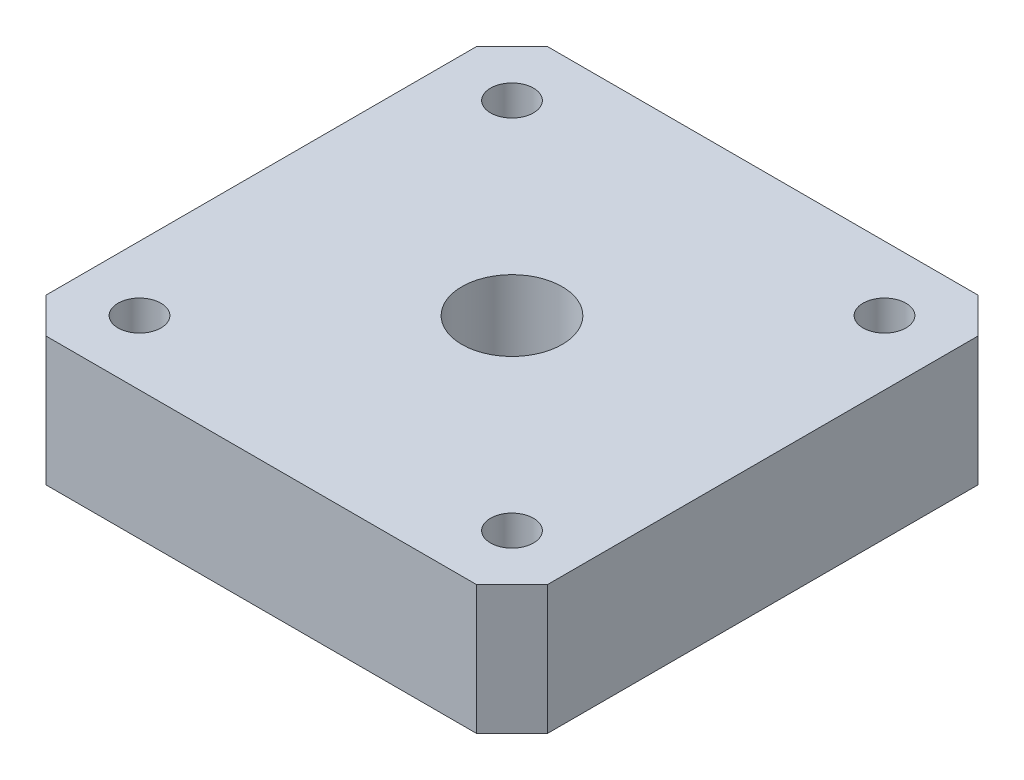
ISO-10303-21;
HEADER;
FILE_DESCRIPTION(('STEP AP214'),'2;1');
FILE_NAME('part.step','',(''),(''),'','','');
FILE_SCHEMA(('AUTOMOTIVE_DESIGN { 1 0 10303 214 1 1 1 1 }'));
ENDSEC;
DATA;
#1=APPLICATION_CONTEXT('core data for automotive mechanical design processes');
#2=APPLICATION_PROTOCOL_DEFINITION('international standard','automotive_design',2000,#1);
#3=PRODUCT_CONTEXT('',#1,'mechanical');
#4=PRODUCT('Part','Part','',(#3));
#5=PRODUCT_RELATED_PRODUCT_CATEGORY('part','',(#4));
#6=PRODUCT_DEFINITION_FORMATION('','',#4);
#7=PRODUCT_DEFINITION_CONTEXT('part definition',#1,'design');
#8=PRODUCT_DEFINITION('design','',#6,#7);
#9=PRODUCT_DEFINITION_SHAPE('','',#8);
#10=(LENGTH_UNIT() NAMED_UNIT(*) SI_UNIT(.MILLI.,.METRE.));
#11=(NAMED_UNIT(*) PLANE_ANGLE_UNIT() SI_UNIT($,.RADIAN.));
#12=(NAMED_UNIT(*) SI_UNIT($,.STERADIAN.) SOLID_ANGLE_UNIT());
#13=UNCERTAINTY_MEASURE_WITH_UNIT(LENGTH_MEASURE(1.E-05),#10,'distance_accuracy_value','');
#14=(GEOMETRIC_REPRESENTATION_CONTEXT(3) GLOBAL_UNCERTAINTY_ASSIGNED_CONTEXT((#13)) GLOBAL_UNIT_ASSIGNED_CONTEXT((#10,
#11,#12)) REPRESENTATION_CONTEXT('',''));
#15=CARTESIAN_POINT('',(0.,0.,0.));
#16=DIRECTION('',(0.,0.,1.));
#17=DIRECTION('',(1.,0.,0.));
#18=AXIS2_PLACEMENT_3D('',#15,#16,#17);
#19=CARTESIAN_POINT('',(0.,9.,-32.5269119345811));
#20=DIRECTION('',(1.,0.,0.));
#21=DIRECTION('',(0.,0.,-1.));
#22=AXIS2_PLACEMENT_3D('',#19,#20,#21);
#23=PLANE('',#22);
#24=DIRECTION('',(0.,0.,1.));
#25=VECTOR('',#24,1.);
#26=CARTESIAN_POINT('',(0.,0.,-32.5269119345811));
#27=LINE('',#26,#25);
#28=CARTESIAN_POINT('',(0.,0.,-32.5269119345811));
#29=VERTEX_POINT('',#28);
#30=CARTESIAN_POINT('',(0.,0.,-2.47308806541876));
#31=VERTEX_POINT('',#30);
#32=EDGE_CURVE('E128',#29,#31,#27,.T.);
#33=ORIENTED_EDGE('',*,*,#32,.T.);
#34=DIRECTION('',(0.,-1.,0.));
#35=VECTOR('',#34,1.);
#36=CARTESIAN_POINT('',(0.,9.,-2.47308806541876));
#37=LINE('',#36,#35);
#38=CARTESIAN_POINT('',(0.,9.,-2.47308806541876));
#39=VERTEX_POINT('',#38);
#40=EDGE_CURVE('E11',#39,#31,#37,.T.);
#41=ORIENTED_EDGE('',*,*,#40,.F.);
#42=DIRECTION('',(0.,0.,1.));
#43=VECTOR('',#42,1.);
#44=CARTESIAN_POINT('',(0.,9.,-32.5269119345811));
#45=LINE('',#44,#43);
#46=CARTESIAN_POINT('',(0.,9.,-32.5269119345811));
#47=VERTEX_POINT('',#46);
#48=EDGE_CURVE('E143',#47,#39,#45,.T.);
#49=ORIENTED_EDGE('',*,*,#48,.F.);
#50=DIRECTION('',(0.,-1.,0.));
#51=VECTOR('',#50,1.);
#52=CARTESIAN_POINT('',(0.,9.,-32.5269119345811));
#53=LINE('',#52,#51);
#54=EDGE_CURVE('E124',#47,#29,#53,.T.);
#55=ORIENTED_EDGE('',*,*,#54,.T.);
#56=EDGE_LOOP('',(#33,#41,#49,#55));
#57=FACE_BOUND('',#56,.T.);
#58=ADVANCED_FACE('F32',(#57),#23,.F.);
#59=CARTESIAN_POINT('',(0.,9.,-2.47308806541876));
#60=DIRECTION('',(0.707106781186549,0.,-0.707106781186546));
#61=DIRECTION('',(-0.707106781186546,0.,-0.707106781186549));
#62=AXIS2_PLACEMENT_3D('',#59,#60,#61);
#63=PLANE('',#62);
#64=DIRECTION('',(0.707106781186546,0.,0.707106781186548));
#65=VECTOR('',#64,1.);
#66=CARTESIAN_POINT('',(0.,0.,-2.47308806541876));
#67=LINE('',#66,#65);
#68=CARTESIAN_POINT('',(2.47308806541877,0.,0.));
#69=VERTEX_POINT('',#68);
#70=EDGE_CURVE('E131',#31,#69,#67,.T.);
#71=ORIENTED_EDGE('',*,*,#70,.T.);
#72=DIRECTION('',(0.,-1.,0.));
#73=VECTOR('',#72,1.);
#74=CARTESIAN_POINT('',(2.47308806541877,9.,0.));
#75=LINE('',#74,#73);
#76=CARTESIAN_POINT('',(2.47308806541877,9.,0.));
#77=VERTEX_POINT('',#76);
#78=EDGE_CURVE('E40',#77,#69,#75,.T.);
#79=ORIENTED_EDGE('',*,*,#78,.F.);
#80=DIRECTION('',(0.707106781186546,0.,0.707106781186548));
#81=VECTOR('',#80,1.);
#82=CARTESIAN_POINT('',(0.,9.,-2.47308806541876));
#83=LINE('',#82,#81);
#84=EDGE_CURVE('E91',#39,#77,#83,.T.);
#85=ORIENTED_EDGE('',*,*,#84,.F.);
#86=ORIENTED_EDGE('',*,*,#40,.T.);
#87=EDGE_LOOP('',(#71,#79,#85,#86));
#88=FACE_BOUND('',#87,.T.);
#89=ADVANCED_FACE('F242',(#88),#63,.F.);
#90=CARTESIAN_POINT('',(2.47308806541877,9.,0.));
#91=DIRECTION('',(0.,0.,-1.));
#92=DIRECTION('',(-1.,0.,0.));
#93=AXIS2_PLACEMENT_3D('',#90,#91,#92);
#94=PLANE('',#93);
#95=DIRECTION('',(1.,0.,0.));
#96=VECTOR('',#95,1.);
#97=CARTESIAN_POINT('',(2.47308806541877,0.,0.));
#98=LINE('',#97,#96);
#99=CARTESIAN_POINT('',(32.5269119345812,0.,0.));
#100=VERTEX_POINT('',#99);
#101=EDGE_CURVE('E134',#69,#100,#98,.T.);
#102=ORIENTED_EDGE('',*,*,#101,.T.);
#103=DIRECTION('',(0.,-1.,0.));
#104=VECTOR('',#103,1.);
#105=CARTESIAN_POINT('',(32.5269119345812,9.,0.));
#106=LINE('',#105,#104);
#107=CARTESIAN_POINT('',(32.5269119345812,9.,0.));
#108=VERTEX_POINT('',#107);
#109=EDGE_CURVE('E150',#108,#100,#106,.T.);
#110=ORIENTED_EDGE('',*,*,#109,.F.);
#111=DIRECTION('',(1.,0.,0.));
#112=VECTOR('',#111,1.);
#113=CARTESIAN_POINT('',(2.47308806541877,9.,0.));
#114=LINE('',#113,#112);
#115=EDGE_CURVE('E158',#77,#108,#114,.T.);
#116=ORIENTED_EDGE('',*,*,#115,.F.);
#117=ORIENTED_EDGE('',*,*,#78,.T.);
#118=EDGE_LOOP('',(#102,#110,#116,#117));
#119=FACE_BOUND('',#118,.T.);
#120=ADVANCED_FACE('F156',(#119),#94,.F.);
#121=CARTESIAN_POINT('',(32.5269119345812,9.,0.));
#122=DIRECTION('',(-0.707106781186545,0.,-0.70710678118655));
#123=DIRECTION('',(-0.70710678118655,0.,0.707106781186545));
#124=AXIS2_PLACEMENT_3D('',#121,#122,#123);
#125=PLANE('',#124);
#126=DIRECTION('',(0.70710678118655,0.,-0.707106781186545));
#127=VECTOR('',#126,1.);
#128=CARTESIAN_POINT('',(32.5269119345812,0.,0.));
#129=LINE('',#128,#127);
#130=CARTESIAN_POINT('',(35.,0.,-2.47308806541876));
#131=VERTEX_POINT('',#130);
#132=EDGE_CURVE('E136',#100,#131,#129,.T.);
#133=ORIENTED_EDGE('',*,*,#132,.T.);
#134=DIRECTION('',(0.,-1.,0.));
#135=VECTOR('',#134,1.);
#136=CARTESIAN_POINT('',(35.,9.,-2.47308806541876));
#137=LINE('',#136,#135);
#138=CARTESIAN_POINT('',(35.,9.,-2.47308806541876));
#139=VERTEX_POINT('',#138);
#140=EDGE_CURVE('E147',#139,#131,#137,.T.);
#141=ORIENTED_EDGE('',*,*,#140,.F.);
#142=DIRECTION('',(0.70710678118655,0.,-0.707106781186545));
#143=VECTOR('',#142,1.);
#144=CARTESIAN_POINT('',(32.5269119345812,9.,0.));
#145=LINE('',#144,#143);
#146=EDGE_CURVE('E170',#108,#139,#145,.T.);
#147=ORIENTED_EDGE('',*,*,#146,.F.);
#148=ORIENTED_EDGE('',*,*,#109,.T.);
#149=EDGE_LOOP('',(#133,#141,#147,#148));
#150=FACE_BOUND('',#149,.T.);
#151=ADVANCED_FACE('F166',(#150),#125,.F.);
#152=CARTESIAN_POINT('',(35.,9.,-2.47308806541876));
#153=DIRECTION('',(-1.,0.,0.));
#154=DIRECTION('',(0.,0.,1.));
#155=AXIS2_PLACEMENT_3D('',#152,#153,#154);
#156=PLANE('',#155);
#157=DIRECTION('',(0.,0.,-1.));
#158=VECTOR('',#157,1.);
#159=CARTESIAN_POINT('',(35.,0.,-2.47308806541876));
#160=LINE('',#159,#158);
#161=CARTESIAN_POINT('',(35.,0.,-32.5269119345811));
#162=VERTEX_POINT('',#161);
#163=EDGE_CURVE('E138',#131,#162,#160,.T.);
#164=ORIENTED_EDGE('',*,*,#163,.T.);
#165=DIRECTION('',(0.,-1.,0.));
#166=VECTOR('',#165,1.);
#167=CARTESIAN_POINT('',(35.,9.,-32.5269119345811));
#168=LINE('',#167,#166);
#169=CARTESIAN_POINT('',(35.,9.,-32.5269119345811));
#170=VERTEX_POINT('',#169);
#171=EDGE_CURVE('E119',#170,#162,#168,.T.);
#172=ORIENTED_EDGE('',*,*,#171,.F.);
#173=DIRECTION('',(0.,0.,-1.));
#174=VECTOR('',#173,1.);
#175=CARTESIAN_POINT('',(35.,9.,-2.47308806541876));
#176=LINE('',#175,#174);
#177=EDGE_CURVE('E110',#139,#170,#176,.T.);
#178=ORIENTED_EDGE('',*,*,#177,.F.);
#179=ORIENTED_EDGE('',*,*,#140,.T.);
#180=EDGE_LOOP('',(#164,#172,#178,#179));
#181=FACE_BOUND('',#180,.T.);
#182=ADVANCED_FACE('F169',(#181),#156,.F.);
#183=CARTESIAN_POINT('',(35.,9.,-32.5269119345811));
#184=DIRECTION('',(-0.707106781186548,0.,0.707106781186547));
#185=DIRECTION('',(0.707106781186547,0.,0.707106781186548));
#186=AXIS2_PLACEMENT_3D('',#183,#184,#185);
#187=PLANE('',#186);
#188=DIRECTION('',(-0.707106781186547,0.,-0.707106781186549));
#189=VECTOR('',#188,1.);
#190=CARTESIAN_POINT('',(35.,0.,-32.5269119345811));
#191=LINE('',#190,#189);
#192=CARTESIAN_POINT('',(32.5269119345812,0.,-34.9999999999999));
#193=VERTEX_POINT('',#192);
#194=EDGE_CURVE('E118',#162,#193,#191,.T.);
#195=ORIENTED_EDGE('',*,*,#194,.T.);
#196=DIRECTION('',(0.,-1.,0.));
#197=VECTOR('',#196,1.);
#198=CARTESIAN_POINT('',(32.5269119345812,9.,-34.9999999999999));
#199=LINE('',#198,#197);
#200=CARTESIAN_POINT('',(32.5269119345812,9.,-34.9999999999999));
#201=VERTEX_POINT('',#200);
#202=EDGE_CURVE('E115',#201,#193,#199,.T.);
#203=ORIENTED_EDGE('',*,*,#202,.F.);
#204=DIRECTION('',(-0.707106781186547,0.,-0.707106781186549));
#205=VECTOR('',#204,1.);
#206=CARTESIAN_POINT('',(35.,9.,-32.5269119345811));
#207=LINE('',#206,#205);
#208=EDGE_CURVE('E104',#170,#201,#207,.T.);
#209=ORIENTED_EDGE('',*,*,#208,.F.);
#210=ORIENTED_EDGE('',*,*,#171,.T.);
#211=EDGE_LOOP('',(#195,#203,#209,#210));
#212=FACE_BOUND('',#211,.T.);
#213=ADVANCED_FACE('F116',(#212),#187,.F.);
#214=CARTESIAN_POINT('',(32.5269119345812,9.,-34.9999999999999));
#215=DIRECTION('',(0.,0.,1.));
#216=DIRECTION('',(1.,0.,0.));
#217=AXIS2_PLACEMENT_3D('',#214,#215,#216);
#218=PLANE('',#217);
#219=DIRECTION('',(-1.,0.,0.));
#220=VECTOR('',#219,1.);
#221=CARTESIAN_POINT('',(32.5269119345812,0.,-34.9999999999999));
#222=LINE('',#221,#220);
#223=CARTESIAN_POINT('',(2.47308806541877,0.,-34.9999999999999));
#224=VERTEX_POINT('',#223);
#225=EDGE_CURVE('E77',#193,#224,#222,.T.);
#226=ORIENTED_EDGE('',*,*,#225,.T.);
#227=DIRECTION('',(0.,-1.,0.));
#228=VECTOR('',#227,1.);
#229=CARTESIAN_POINT('',(2.47308806541877,9.,-34.9999999999999));
#230=LINE('',#229,#228);
#231=CARTESIAN_POINT('',(2.47308806541877,9.,-34.9999999999999));
#232=VERTEX_POINT('',#231);
#233=EDGE_CURVE('E120',#232,#224,#230,.T.);
#234=ORIENTED_EDGE('',*,*,#233,.F.);
#235=DIRECTION('',(-1.,0.,0.));
#236=VECTOR('',#235,1.);
#237=CARTESIAN_POINT('',(32.5269119345812,9.,-34.9999999999999));
#238=LINE('',#237,#236);
#239=EDGE_CURVE('E108',#201,#232,#238,.T.);
#240=ORIENTED_EDGE('',*,*,#239,.F.);
#241=ORIENTED_EDGE('',*,*,#202,.T.);
#242=EDGE_LOOP('',(#226,#234,#240,#241));
#243=FACE_BOUND('',#242,.T.);
#244=ADVANCED_FACE('F122',(#243),#218,.F.);
#245=CARTESIAN_POINT('',(2.47308806541877,9.,-34.9999999999999));
#246=DIRECTION('',(0.707106781186547,0.,0.707106781186548));
#247=DIRECTION('',(0.707106781186548,0.,-0.707106781186547));
#248=AXIS2_PLACEMENT_3D('',#245,#246,#247);
#249=PLANE('',#248);
#250=DIRECTION('',(-0.707106781186549,0.,0.707106781186547));
#251=VECTOR('',#250,1.);
#252=CARTESIAN_POINT('',(2.47308806541877,0.,-34.9999999999999));
#253=LINE('',#252,#251);
#254=EDGE_CURVE('E83',#224,#29,#253,.T.);
#255=ORIENTED_EDGE('',*,*,#254,.T.);
#256=ORIENTED_EDGE('',*,*,#54,.F.);
#257=DIRECTION('',(-0.707106781186549,0.,0.707106781186547));
#258=VECTOR('',#257,1.);
#259=CARTESIAN_POINT('',(2.47308806541877,9.,-34.9999999999999));
#260=LINE('',#259,#258);
#261=EDGE_CURVE('E48',#232,#47,#260,.T.);
#262=ORIENTED_EDGE('',*,*,#261,.F.);
#263=ORIENTED_EDGE('',*,*,#233,.T.);
#264=EDGE_LOOP('',(#255,#256,#262,#263));
#265=FACE_BOUND('',#264,.T.);
#266=ADVANCED_FACE('F217',(#265),#249,.F.);
#267=CARTESIAN_POINT('',(0.,9.,0.));
#268=DIRECTION('',(0.,1.,0.));
#269=DIRECTION('',(0.,0.,1.));
#270=AXIS2_PLACEMENT_3D('',#267,#268,#269);
#271=PLANE('',#270);
#272=CARTESIAN_POINT('',(4.5000000000006,9.,-4.50000000000008));
#273=DIRECTION('',(0.,1.,0.));
#274=DIRECTION('',(0.,0.,1.));
#275=AXIS2_PLACEMENT_3D('',#272,#273,#274);
#276=CIRCLE('',#275,1.5);
#277=CARTESIAN_POINT('',(4.5000000000006,9.,-3.00000000000007));
#278=VERTEX_POINT('',#277);
#279=EDGE_CURVE('E200',#278,#278,#276,.T.);
#280=ORIENTED_EDGE('',*,*,#279,.F.);
#281=EDGE_LOOP('',(#280));
#282=FACE_BOUND('',#281,.T.);
#283=CARTESIAN_POINT('',(30.5000000000006,9.,-4.50000000000058));
#284=DIRECTION('',(0.,1.,0.));
#285=DIRECTION('',(0.,0.,1.));
#286=AXIS2_PLACEMENT_3D('',#283,#284,#285);
#287=CIRCLE('',#286,1.5);
#288=CARTESIAN_POINT('',(30.5000000000006,9.,-3.00000000000058));
#289=VERTEX_POINT('',#288);
#290=EDGE_CURVE('E194',#289,#289,#287,.T.);
#291=ORIENTED_EDGE('',*,*,#290,.F.);
#292=EDGE_LOOP('',(#291));
#293=FACE_BOUND('',#292,.T.);
#294=CARTESIAN_POINT('',(30.5,9.,-30.5000000000006));
#295=DIRECTION('',(0.,1.,0.));
#296=DIRECTION('',(0.,0.,1.));
#297=AXIS2_PLACEMENT_3D('',#294,#295,#296);
#298=CIRCLE('',#297,1.5);
#299=CARTESIAN_POINT('',(30.5,9.,-29.0000000000006));
#300=VERTEX_POINT('',#299);
#301=EDGE_CURVE('E188',#300,#300,#298,.T.);
#302=ORIENTED_EDGE('',*,*,#301,.F.);
#303=EDGE_LOOP('',(#302));
#304=FACE_BOUND('',#303,.T.);
#305=CARTESIAN_POINT('',(4.5,9.,-30.4999999999999));
#306=DIRECTION('',(0.,1.,0.));
#307=DIRECTION('',(0.,0.,1.));
#308=AXIS2_PLACEMENT_3D('',#305,#306,#307);
#309=CIRCLE('',#308,1.5);
#310=CARTESIAN_POINT('',(4.5,9.,-28.9999999999999));
#311=VERTEX_POINT('',#310);
#312=EDGE_CURVE('E182',#311,#311,#309,.T.);
#313=ORIENTED_EDGE('',*,*,#312,.F.);
#314=EDGE_LOOP('',(#313));
#315=FACE_BOUND('',#314,.T.);
#316=CARTESIAN_POINT('',(17.5,9.,-17.4999999999999));
#317=DIRECTION('',(0.,1.,0.));
#318=DIRECTION('',(0.,0.,1.));
#319=AXIS2_PLACEMENT_3D('',#316,#317,#318);
#320=CIRCLE('',#319,3.5);
#321=CARTESIAN_POINT('',(17.5,9.,-13.9999999999999));
#322=VERTEX_POINT('',#321);
#323=EDGE_CURVE('E176',#322,#322,#320,.T.);
#324=ORIENTED_EDGE('',*,*,#323,.F.);
#325=EDGE_LOOP('',(#324));
#326=FACE_BOUND('',#325,.T.);
#327=ORIENTED_EDGE('',*,*,#48,.T.);
#328=ORIENTED_EDGE('',*,*,#84,.T.);
#329=ORIENTED_EDGE('',*,*,#115,.T.);
#330=ORIENTED_EDGE('',*,*,#146,.T.);
#331=ORIENTED_EDGE('',*,*,#177,.T.);
#332=ORIENTED_EDGE('',*,*,#208,.T.);
#333=ORIENTED_EDGE('',*,*,#239,.T.);
#334=ORIENTED_EDGE('',*,*,#261,.T.);
#335=EDGE_LOOP('',(#327,#328,#329,#330,#331,#332,#333,#334));
#336=FACE_BOUND('',#335,.T.);
#337=ADVANCED_FACE('F106',(#282,#293,#304,#315,#326,#336),#271,.T.);
#338=CARTESIAN_POINT('',(0.,0.,0.));
#339=DIRECTION('',(0.,1.,0.));
#340=DIRECTION('',(0.,0.,1.));
#341=AXIS2_PLACEMENT_3D('',#338,#339,#340);
#342=PLANE('',#341);
#343=CARTESIAN_POINT('',(4.5000000000006,0.,-4.50000000000008));
#344=DIRECTION('',(0.,1.,0.));
#345=DIRECTION('',(0.,0.,1.));
#346=AXIS2_PLACEMENT_3D('',#343,#344,#345);
#347=CIRCLE('',#346,1.5);
#348=CARTESIAN_POINT('',(4.5000000000006,0.,-3.00000000000007));
#349=VERTEX_POINT('',#348);
#350=EDGE_CURVE('E197',#349,#349,#347,.T.);
#351=ORIENTED_EDGE('',*,*,#350,.T.);
#352=EDGE_LOOP('',(#351));
#353=FACE_BOUND('',#352,.T.);
#354=CARTESIAN_POINT('',(30.5000000000006,0.,-4.50000000000058));
#355=DIRECTION('',(0.,1.,0.));
#356=DIRECTION('',(0.,0.,1.));
#357=AXIS2_PLACEMENT_3D('',#354,#355,#356);
#358=CIRCLE('',#357,1.5);
#359=CARTESIAN_POINT('',(30.5000000000006,0.,-3.00000000000058));
#360=VERTEX_POINT('',#359);
#361=EDGE_CURVE('E191',#360,#360,#358,.T.);
#362=ORIENTED_EDGE('',*,*,#361,.T.);
#363=EDGE_LOOP('',(#362));
#364=FACE_BOUND('',#363,.T.);
#365=CARTESIAN_POINT('',(30.5,0.,-30.5000000000006));
#366=DIRECTION('',(0.,1.,0.));
#367=DIRECTION('',(0.,0.,1.));
#368=AXIS2_PLACEMENT_3D('',#365,#366,#367);
#369=CIRCLE('',#368,1.5);
#370=CARTESIAN_POINT('',(30.5,0.,-29.0000000000006));
#371=VERTEX_POINT('',#370);
#372=EDGE_CURVE('E185',#371,#371,#369,.T.);
#373=ORIENTED_EDGE('',*,*,#372,.T.);
#374=EDGE_LOOP('',(#373));
#375=FACE_BOUND('',#374,.T.);
#376=CARTESIAN_POINT('',(4.5,0.,-30.4999999999999));
#377=DIRECTION('',(0.,1.,0.));
#378=DIRECTION('',(0.,0.,1.));
#379=AXIS2_PLACEMENT_3D('',#376,#377,#378);
#380=CIRCLE('',#379,1.5);
#381=CARTESIAN_POINT('',(4.5,0.,-28.9999999999999));
#382=VERTEX_POINT('',#381);
#383=EDGE_CURVE('E179',#382,#382,#380,.T.);
#384=ORIENTED_EDGE('',*,*,#383,.T.);
#385=EDGE_LOOP('',(#384));
#386=FACE_BOUND('',#385,.T.);
#387=CARTESIAN_POINT('',(17.5,0.,-17.4999999999999));
#388=DIRECTION('',(0.,1.,0.));
#389=DIRECTION('',(0.,0.,1.));
#390=AXIS2_PLACEMENT_3D('',#387,#388,#389);
#391=CIRCLE('',#390,3.5);
#392=CARTESIAN_POINT('',(17.5,0.,-13.9999999999999));
#393=VERTEX_POINT('',#392);
#394=EDGE_CURVE('E132',#393,#393,#391,.T.);
#395=ORIENTED_EDGE('',*,*,#394,.T.);
#396=EDGE_LOOP('',(#395));
#397=FACE_BOUND('',#396,.T.);
#398=ORIENTED_EDGE('',*,*,#32,.F.);
#399=ORIENTED_EDGE('',*,*,#254,.F.);
#400=ORIENTED_EDGE('',*,*,#225,.F.);
#401=ORIENTED_EDGE('',*,*,#194,.F.);
#402=ORIENTED_EDGE('',*,*,#163,.F.);
#403=ORIENTED_EDGE('',*,*,#132,.F.);
#404=ORIENTED_EDGE('',*,*,#101,.F.);
#405=ORIENTED_EDGE('',*,*,#70,.F.);
#406=EDGE_LOOP('',(#398,#399,#400,#401,#402,#403,#404,#405));
#407=FACE_BOUND('',#406,.T.);
#408=ADVANCED_FACE('F162',(#353,#364,#375,#386,#397,#407),#342,.F.);
#409=CARTESIAN_POINT('',(17.5,0.,-17.4999999999999));
#410=DIRECTION('',(0.,1.,0.));
#411=DIRECTION('',(0.,0.,1.));
#412=AXIS2_PLACEMENT_3D('',#409,#410,#411);
#413=CYLINDRICAL_SURFACE('',#412,3.5);
#414=ORIENTED_EDGE('',*,*,#394,.F.);
#415=EDGE_LOOP('',(#414));
#416=FACE_BOUND('',#415,.T.);
#417=ORIENTED_EDGE('',*,*,#323,.T.);
#418=EDGE_LOOP('',(#417));
#419=FACE_BOUND('',#418,.T.);
#420=ADVANCED_FACE('F227',(#416,#419),#413,.F.);
#421=CARTESIAN_POINT('',(4.5,0.,-30.4999999999999));
#422=DIRECTION('',(0.,1.,0.));
#423=DIRECTION('',(0.,0.,1.));
#424=AXIS2_PLACEMENT_3D('',#421,#422,#423);
#425=CYLINDRICAL_SURFACE('',#424,1.5);
#426=ORIENTED_EDGE('',*,*,#383,.F.);
#427=EDGE_LOOP('',(#426));
#428=FACE_BOUND('',#427,.T.);
#429=ORIENTED_EDGE('',*,*,#312,.T.);
#430=EDGE_LOOP('',(#429));
#431=FACE_BOUND('',#430,.T.);
#432=ADVANCED_FACE('F229',(#428,#431),#425,.F.);
#433=CARTESIAN_POINT('',(30.5,0.,-30.5000000000006));
#434=DIRECTION('',(0.,1.,0.));
#435=DIRECTION('',(0.,0.,1.));
#436=AXIS2_PLACEMENT_3D('',#433,#434,#435);
#437=CYLINDRICAL_SURFACE('',#436,1.5);
#438=ORIENTED_EDGE('',*,*,#372,.F.);
#439=EDGE_LOOP('',(#438));
#440=FACE_BOUND('',#439,.T.);
#441=ORIENTED_EDGE('',*,*,#301,.T.);
#442=EDGE_LOOP('',(#441));
#443=FACE_BOUND('',#442,.T.);
#444=ADVANCED_FACE('F236',(#440,#443),#437,.F.);
#445=CARTESIAN_POINT('',(30.5000000000006,0.,-4.50000000000058));
#446=DIRECTION('',(0.,1.,0.));
#447=DIRECTION('',(0.,0.,1.));
#448=AXIS2_PLACEMENT_3D('',#445,#446,#447);
#449=CYLINDRICAL_SURFACE('',#448,1.5);
#450=ORIENTED_EDGE('',*,*,#361,.F.);
#451=EDGE_LOOP('',(#450));
#452=FACE_BOUND('',#451,.T.);
#453=ORIENTED_EDGE('',*,*,#290,.T.);
#454=EDGE_LOOP('',(#453));
#455=FACE_BOUND('',#454,.T.);
#456=ADVANCED_FACE('F211',(#452,#455),#449,.F.);
#457=CARTESIAN_POINT('',(4.5000000000006,0.,-4.50000000000008));
#458=DIRECTION('',(0.,1.,0.));
#459=DIRECTION('',(0.,0.,1.));
#460=AXIS2_PLACEMENT_3D('',#457,#458,#459);
#461=CYLINDRICAL_SURFACE('',#460,1.5);
#462=ORIENTED_EDGE('',*,*,#350,.F.);
#463=EDGE_LOOP('',(#462));
#464=FACE_BOUND('',#463,.T.);
#465=ORIENTED_EDGE('',*,*,#279,.T.);
#466=EDGE_LOOP('',(#465));
#467=FACE_BOUND('',#466,.T.);
#468=ADVANCED_FACE('F208',(#464,#467),#461,.F.);
#469=CLOSED_SHELL('',(#58,#89,#120,#151,#182,#213,#244,#266,#337,#408,#420,#432,#444,#456,#468));
#470=MANIFOLD_SOLID_BREP('B2',#469);
#471=ADVANCED_BREP_SHAPE_REPRESENTATION('',(#18,#470),#14);
#472=SHAPE_DEFINITION_REPRESENTATION(#9,#471);
ENDSEC;
END-ISO-10303-21;
